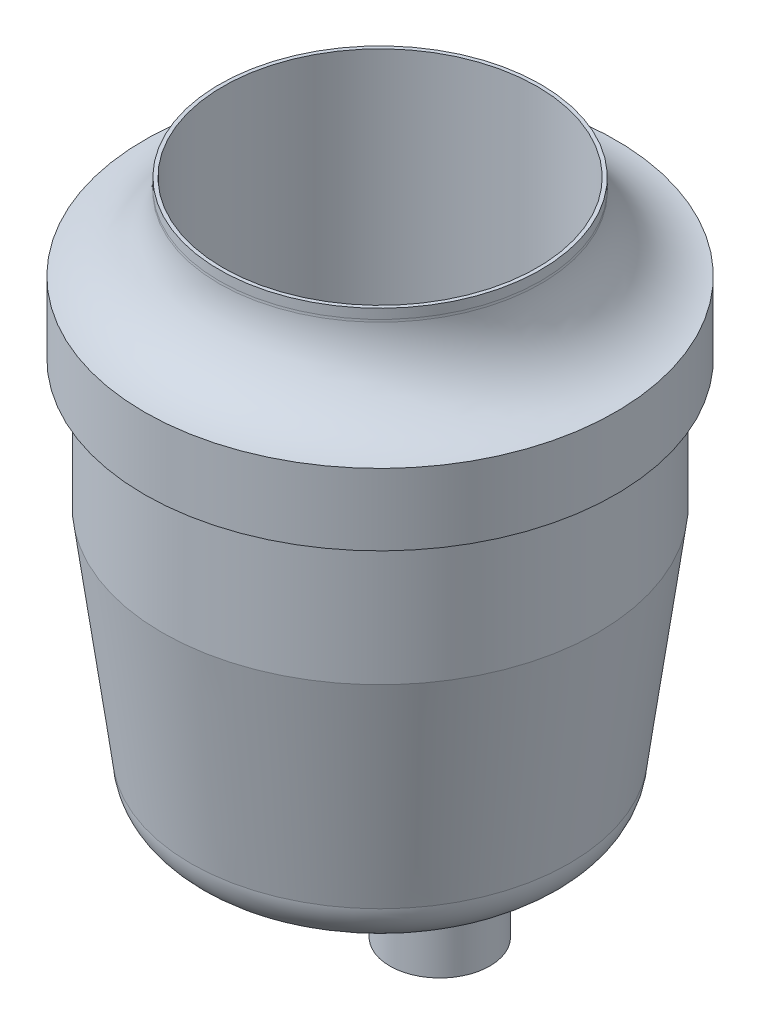
ISO-10303-21;
HEADER;
FILE_DESCRIPTION(('STEP AP214'),'2;1');
FILE_NAME('part.step','',(''),(''),'','','');
FILE_SCHEMA(('AUTOMOTIVE_DESIGN { 1 0 10303 214 1 1 1 1 }'));
ENDSEC;
DATA;
#1=APPLICATION_CONTEXT('core data for automotive mechanical design processes');
#2=APPLICATION_PROTOCOL_DEFINITION('international standard','automotive_design',2000,#1);
#3=PRODUCT_CONTEXT('',#1,'mechanical');
#4=PRODUCT('Part','Part','',(#3));
#5=PRODUCT_RELATED_PRODUCT_CATEGORY('part','',(#4));
#6=PRODUCT_DEFINITION_FORMATION('','',#4);
#7=PRODUCT_DEFINITION_CONTEXT('part definition',#1,'design');
#8=PRODUCT_DEFINITION('design','',#6,#7);
#9=PRODUCT_DEFINITION_SHAPE('','',#8);
#10=(LENGTH_UNIT() NAMED_UNIT(*) SI_UNIT(.MILLI.,.METRE.));
#11=(NAMED_UNIT(*) PLANE_ANGLE_UNIT() SI_UNIT($,.RADIAN.));
#12=(NAMED_UNIT(*) SI_UNIT($,.STERADIAN.) SOLID_ANGLE_UNIT());
#13=UNCERTAINTY_MEASURE_WITH_UNIT(LENGTH_MEASURE(1.E-05),#10,'distance_accuracy_value','');
#14=(GEOMETRIC_REPRESENTATION_CONTEXT(3) GLOBAL_UNCERTAINTY_ASSIGNED_CONTEXT((#13)) GLOBAL_UNIT_ASSIGNED_CONTEXT((#10,
#11,#12)) REPRESENTATION_CONTEXT('',''));
#15=CARTESIAN_POINT('',(0.,0.,0.));
#16=DIRECTION('',(0.,0.,1.));
#17=DIRECTION('',(1.,0.,0.));
#18=AXIS2_PLACEMENT_3D('',#15,#16,#17);
#19=CARTESIAN_POINT('',(0.,11.43,0.));
#20=DIRECTION('',(0.,-1.,0.));
#21=DIRECTION('',(0.,0.,-1.));
#22=AXIS2_PLACEMENT_3D('',#19,#20,#21);
#23=CYLINDRICAL_SURFACE('',#22,19.3675);
#24=CARTESIAN_POINT('',(0.,11.43,0.));
#25=DIRECTION('',(0.,1.,0.));
#26=DIRECTION('',(0.,0.,1.));
#27=AXIS2_PLACEMENT_3D('',#24,#25,#26);
#28=CIRCLE('',#27,19.3675);
#29=CARTESIAN_POINT('',(0.,11.43,19.3675));
#30=VERTEX_POINT('',#29);
#31=EDGE_CURVE('E210',#30,#30,#28,.T.);
#32=ORIENTED_EDGE('',*,*,#31,.F.);
#33=EDGE_LOOP('',(#32));
#34=FACE_BOUND('',#33,.T.);
#35=CARTESIAN_POINT('',(0.,0.,0.));
#36=DIRECTION('',(0.,1.,0.));
#37=DIRECTION('',(0.,0.,1.));
#38=AXIS2_PLACEMENT_3D('',#35,#36,#37);
#39=CIRCLE('',#38,19.3675);
#40=CARTESIAN_POINT('',(0.,0.,19.3675));
#41=VERTEX_POINT('',#40);
#42=EDGE_CURVE('E97',#41,#41,#39,.T.);
#43=ORIENTED_EDGE('',*,*,#42,.T.);
#44=EDGE_LOOP('',(#43));
#45=FACE_BOUND('',#44,.T.);
#46=ADVANCED_FACE('F39',(#34,#45),#23,.T.);
#47=CARTESIAN_POINT('',(0.,17.78,0.));
#48=DIRECTION('',(0.,-1.,0.));
#49=DIRECTION('',(0.,0.,-1.));
#50=AXIS2_PLACEMENT_3D('',#47,#48,#49);
#51=CYLINDRICAL_SURFACE('',#50,20.955);
#52=CARTESIAN_POINT('',(0.,17.78,0.));
#53=DIRECTION('',(0.,1.,0.));
#54=DIRECTION('',(0.,0.,1.));
#55=AXIS2_PLACEMENT_3D('',#52,#53,#54);
#56=CIRCLE('',#55,20.955);
#57=CARTESIAN_POINT('',(0.,17.78,20.955));
#58=VERTEX_POINT('',#57);
#59=EDGE_CURVE('E206',#58,#58,#56,.T.);
#60=ORIENTED_EDGE('',*,*,#59,.F.);
#61=EDGE_LOOP('',(#60));
#62=FACE_BOUND('',#61,.T.);
#63=CARTESIAN_POINT('',(0.,11.43,0.));
#64=DIRECTION('',(0.,1.,0.));
#65=DIRECTION('',(0.,0.,1.));
#66=AXIS2_PLACEMENT_3D('',#63,#64,#65);
#67=CIRCLE('',#66,20.955);
#68=CARTESIAN_POINT('',(0.,11.43,20.955));
#69=VERTEX_POINT('',#68);
#70=EDGE_CURVE('E205',#69,#69,#67,.T.);
#71=ORIENTED_EDGE('',*,*,#70,.T.);
#72=EDGE_LOOP('',(#71));
#73=FACE_BOUND('',#72,.T.);
#74=ADVANCED_FACE('F147',(#62,#73),#51,.T.);
#75=CARTESIAN_POINT('',(0.,11.43,0.));
#76=DIRECTION('',(0.,1.,0.));
#77=DIRECTION('',(0.,0.,1.));
#78=AXIS2_PLACEMENT_3D('',#75,#76,#77);
#79=PLANE('',#78);
#80=ORIENTED_EDGE('',*,*,#31,.T.);
#81=EDGE_LOOP('',(#80));
#82=FACE_BOUND('',#81,.T.);
#83=ORIENTED_EDGE('',*,*,#70,.F.);
#84=EDGE_LOOP('',(#83));
#85=FACE_BOUND('',#84,.T.);
#86=ADVANCED_FACE('F137',(#82,#85),#79,.F.);
#87=CARTESIAN_POINT('',(0.,24.92375,0.));
#88=DIRECTION('',(0.,-1.,0.));
#89=DIRECTION('',(0.,0.,-1.));
#90=AXIS2_PLACEMENT_3D('',#87,#88,#89);
#91=TOROIDAL_SURFACE('',#90,21.43125,7.15960740020008);
#92=CARTESIAN_POINT('',(0.,24.3310367279127,0.));
#93=DIRECTION('',(0.,1.,0.));
#94=DIRECTION('',(0.,0.,1.));
#95=AXIS2_PLACEMENT_3D('',#92,#93,#94);
#96=CIRCLE('',#95,14.2962188786879);
#97=CARTESIAN_POINT('',(0.,24.3310367279127,14.2962188786879));
#98=VERTEX_POINT('',#97);
#99=EDGE_CURVE('E221',#98,#98,#96,.F.);
#100=ORIENTED_EDGE('',*,*,#99,.T.);
#101=EDGE_LOOP('',(#100));
#102=FACE_BOUND('',#101,.T.);
#103=ORIENTED_EDGE('',*,*,#59,.T.);
#104=EDGE_LOOP('',(#103));
#105=FACE_BOUND('',#104,.T.);
#106=ADVANCED_FACE('F133',(#102,#105),#91,.F.);
#107=CARTESIAN_POINT('',(0.,25.4,0.));
#108=DIRECTION('',(0.,1.,0.));
#109=DIRECTION('',(0.,0.,1.));
#110=AXIS2_PLACEMENT_3D('',#107,#108,#109);
#111=PLANE('',#110);
#112=CARTESIAN_POINT('',(0.,25.4,0.));
#113=DIRECTION('',(0.,1.,0.));
#114=DIRECTION('',(0.,0.,1.));
#115=AXIS2_PLACEMENT_3D('',#112,#113,#114);
#116=CIRCLE('',#115,13.97);
#117=CARTESIAN_POINT('',(0.,25.4,13.97));
#118=VERTEX_POINT('',#117);
#119=EDGE_CURVE('E190',#118,#118,#116,.T.);
#120=ORIENTED_EDGE('',*,*,#119,.F.);
#121=EDGE_LOOP('',(#120));
#122=FACE_BOUND('',#121,.T.);
#123=CARTESIAN_POINT('',(0.,25.4,0.));
#124=DIRECTION('',(0.,1.,0.));
#125=DIRECTION('',(0.,0.,1.));
#126=AXIS2_PLACEMENT_3D('',#123,#124,#125);
#127=CIRCLE('',#126,14.2875);
#128=CARTESIAN_POINT('',(0.,25.4,-14.2875));
#129=VERTEX_POINT('',#128);
#130=EDGE_CURVE('E201',#129,#129,#127,.T.);
#131=ORIENTED_EDGE('',*,*,#130,.T.);
#132=EDGE_LOOP('',(#131));
#133=FACE_BOUND('',#132,.T.);
#134=ADVANCED_FACE('F136',(#122,#133),#111,.T.);
#135=CARTESIAN_POINT('',(0.,25.4,0.));
#136=DIRECTION('',(0.,-1.,0.));
#137=DIRECTION('',(0.,0.,-1.));
#138=AXIS2_PLACEMENT_3D('',#135,#136,#137);
#139=CYLINDRICAL_SURFACE('',#138,14.2875);
#140=CARTESIAN_POINT('',(0.,24.5413124632916,0.));
#141=DIRECTION('',(0.,1.,0.));
#142=DIRECTION('',(0.,0.,1.));
#143=AXIS2_PLACEMENT_3D('',#140,#141,#142);
#144=CIRCLE('',#143,14.2875);
#145=CARTESIAN_POINT('',(0.,24.5413124632916,-14.2875));
#146=VERTEX_POINT('',#145);
#147=EDGE_CURVE('E217',#146,#146,#144,.T.);
#148=CARTESIAN_POINT('',(0.,24.5413124632916,-14.2875));
#149=CARTESIAN_POINT('',(0.,24.5502571251324,-14.2875));
#150=CARTESIAN_POINT('',(0.,24.5592017869731,-14.2875));
#151=CARTESIAN_POINT('',(0.,24.5770911106545,-14.2875));
#152=CARTESIAN_POINT('',(0.,24.5860357724952,-14.2875));
#153=CARTESIAN_POINT('',(0.,24.6039250961766,-14.2875));
#154=CARTESIAN_POINT('',(0.,24.6128697580173,-14.2875));
#155=CARTESIAN_POINT('',(0.,24.6307590816988,-14.2875));
#156=CARTESIAN_POINT('',(0.,24.6397037435395,-14.2875));
#157=CARTESIAN_POINT('',(0.,24.6575930672209,-14.2875));
#158=CARTESIAN_POINT('',(0.,24.6665377290616,-14.2875));
#159=CARTESIAN_POINT('',(0.,24.684427052743,-14.2875));
#160=CARTESIAN_POINT('',(0.,24.6933717145837,-14.2875));
#161=CARTESIAN_POINT('',(0.,24.7112610382652,-14.2875));
#162=CARTESIAN_POINT('',(0.,24.7202057001059,-14.2875));
#163=CARTESIAN_POINT('',(0.,24.7380950237873,-14.2875));
#164=CARTESIAN_POINT('',(0.,24.747039685628,-14.2875));
#165=CARTESIAN_POINT('',(0.,24.7649290093094,-14.2875));
#166=CARTESIAN_POINT('',(0.,24.7738736711502,-14.2875));
#167=CARTESIAN_POINT('',(0.,24.7917629948316,-14.2875));
#168=CARTESIAN_POINT('',(0.,24.8007076566723,-14.2875));
#169=CARTESIAN_POINT('',(0.,24.8185969803537,-14.2875));
#170=CARTESIAN_POINT('',(0.,24.8275416421944,-14.2875));
#171=CARTESIAN_POINT('',(0.,24.8454309658758,-14.2875));
#172=CARTESIAN_POINT('',(0.,24.8543756277166,-14.2875));
#173=CARTESIAN_POINT('',(0.,24.872264951398,-14.2875));
#174=CARTESIAN_POINT('',(0.,24.8812096132387,-14.2875));
#175=CARTESIAN_POINT('',(0.,24.8990989369201,-14.2875));
#176=CARTESIAN_POINT('',(0.,24.9080435987608,-14.2875));
#177=CARTESIAN_POINT('',(0.,24.9259329224423,-14.2875));
#178=CARTESIAN_POINT('',(0.,24.934877584283,-14.2875));
#179=CARTESIAN_POINT('',(0.,24.9527669079644,-14.2875));
#180=CARTESIAN_POINT('',(0.,24.9617115698051,-14.2875));
#181=CARTESIAN_POINT('',(0.,24.9796008934865,-14.2875));
#182=CARTESIAN_POINT('',(0.,24.9885455553272,-14.2875));
#183=CARTESIAN_POINT('',(0.,25.0064348790087,-14.2875));
#184=CARTESIAN_POINT('',(0.,25.0153795408494,-14.2875));
#185=CARTESIAN_POINT('',(0.,25.0332688645308,-14.2875));
#186=CARTESIAN_POINT('',(0.,25.0422135263715,-14.2875));
#187=CARTESIAN_POINT('',(0.,25.0601028500529,-14.2875));
#188=CARTESIAN_POINT('',(0.,25.0690475118937,-14.2875));
#189=CARTESIAN_POINT('',(0.,25.0869368355751,-14.2875));
#190=CARTESIAN_POINT('',(0.,25.0958814974158,-14.2875));
#191=CARTESIAN_POINT('',(0.,25.1137708210972,-14.2875));
#192=CARTESIAN_POINT('',(0.,25.1227154829379,-14.2875));
#193=CARTESIAN_POINT('',(0.,25.1406048066193,-14.2875));
#194=CARTESIAN_POINT('',(0.,25.1495494684601,-14.2875));
#195=CARTESIAN_POINT('',(0.,25.1674387921415,-14.2875));
#196=CARTESIAN_POINT('',(0.,25.1763834539822,-14.2875));
#197=CARTESIAN_POINT('',(0.,25.1942727776636,-14.2875));
#198=CARTESIAN_POINT('',(0.,25.2032174395043,-14.2875));
#199=CARTESIAN_POINT('',(0.,25.2211067631858,-14.2875));
#200=CARTESIAN_POINT('',(0.,25.2300514250265,-14.2875));
#201=CARTESIAN_POINT('',(0.,25.2479407487079,-14.2875));
#202=CARTESIAN_POINT('',(0.,25.2568854105486,-14.2875));
#203=CARTESIAN_POINT('',(0.,25.27477473423,-14.2875));
#204=CARTESIAN_POINT('',(0.,25.2837193960707,-14.2875));
#205=CARTESIAN_POINT('',(0.,25.3016087197522,-14.2875));
#206=CARTESIAN_POINT('',(0.,25.3105533815929,-14.2875));
#207=CARTESIAN_POINT('',(0.,25.3284427052743,-14.2875));
#208=CARTESIAN_POINT('',(0.,25.337387367115,-14.2875));
#209=CARTESIAN_POINT('',(0.,25.3552766907964,-14.2875));
#210=CARTESIAN_POINT('',(0.,25.3642213526371,-14.2875));
#211=CARTESIAN_POINT('',(0.,25.3821106763186,-14.2875));
#212=CARTESIAN_POINT('',(0.,25.3910553381593,-14.2875));
#213=CARTESIAN_POINT('',(0.,25.4,-14.2875));
#214=B_SPLINE_CURVE_WITH_KNOTS('',3,(#148,#149,#150,#151,#152,#153,#154,#155,#156,#157,#158,
#159,#160,#161,#162,#163,#164,#165,#166,#167,#168,#169,#170,#171,#172,#173,#174,#175,#176,#177,
#178,#179,#180,#181,#182,#183,#184,#185,#186,#187,#188,#189,#190,#191,#192,#193,#194,#195,#196,
#197,#198,#199,#200,#201,#202,#203,#204,#205,#206,#207,#208,#209,#210,#211,#212,#213),
.UNSPECIFIED.,.F.,.F.,(4,2,2,2,2,2,2,2,2,2,2,2,2,2,2,2,2,2,2,2,2,2,2,2,2,2,2,2,2,2,2,2,4),(0.,
0.0268339855221331,0.0536679710442696,0.0805019565664061,0.107335942088543,0.134169927610679,
0.161003913132812,0.187837898654949,0.214671884177085,0.241505869699222,0.268339855221358,
0.295173840743491,0.322007826265628,0.348841811787765,0.375675797309901,0.402509782832038,
0.429343768354174,0.456177753876307,0.483011739398444,0.50984572492058,0.536679710442717,
0.563513695964853,0.590347681486986,0.617181667009123,0.644015652531259,0.670849638053396,
0.697683623575532,0.724517609097666,0.751351594619802,0.778185580141939,0.805019565664075,
0.831853551186212,0.858687536708348),.UNSPECIFIED.);
#215=EDGE_CURVE('BSEAM131',#146,#129,#214,.T.);
#216=ORIENTED_EDGE('',*,*,#147,.T.);
#217=ORIENTED_EDGE('',*,*,#130,.F.);
#218=ORIENTED_EDGE('',*,*,#215,.T.);
#219=ORIENTED_EDGE('',*,*,#215,.F.);
#220=EDGE_LOOP('',(#216,#218,#217,#219));
#221=FACE_BOUND('',#220,.T.);
#222=ADVANCED_FACE('F131',(#221),#139,.T.);
#223=CARTESIAN_POINT('',(0.,0.,0.));
#224=DIRECTION('',(0.,1.,0.));
#225=DIRECTION('',(0.,0.,1.));
#226=AXIS2_PLACEMENT_3D('',#223,#224,#225);
#227=CONICAL_SURFACE('',#226,19.3675,0.132551532296674);
#228=CARTESIAN_POINT('',(0.,-19.05,0.));
#229=DIRECTION('',(0.,1.,0.));
#230=DIRECTION('',(0.,0.,1.));
#231=AXIS2_PLACEMENT_3D('',#228,#229,#230);
#232=CIRCLE('',#231,16.8275);
#233=CARTESIAN_POINT('',(0.,-19.05,16.8275));
#234=VERTEX_POINT('',#233);
#235=EDGE_CURVE('E91',#234,#234,#232,.T.);
#236=ORIENTED_EDGE('',*,*,#235,.T.);
#237=EDGE_LOOP('',(#236));
#238=FACE_BOUND('',#237,.T.);
#239=ORIENTED_EDGE('',*,*,#42,.F.);
#240=EDGE_LOOP('',(#239));
#241=FACE_BOUND('',#240,.T.);
#242=ADVANCED_FACE('F127',(#238,#241),#227,.T.);
#243=CARTESIAN_POINT('',(0.,-18.89125,0.));
#244=DIRECTION('',(0.,1.,0.));
#245=DIRECTION('',(0.,0.,1.));
#246=AXIS2_PLACEMENT_3D('',#243,#244,#245);
#247=TOROIDAL_SURFACE('',#246,12.85875,3.97192373101499);
#248=CARTESIAN_POINT('',(0.,-22.86,0.));
#249=DIRECTION('',(0.,1.,0.));
#250=DIRECTION('',(0.,0.,1.));
#251=AXIS2_PLACEMENT_3D('',#248,#249,#250);
#252=CIRCLE('',#251,12.7);
#253=CARTESIAN_POINT('',(-12.2629171870465,-22.86,3.30315940633214));
#254=VERTEX_POINT('',#253);
#255=CARTESIAN_POINT('',(-12.2629171870465,-22.86,-3.30315940633214));
#256=VERTEX_POINT('',#255);
#257=EDGE_CURVE('E85',#254,#256,#252,.T.);
#258=ORIENTED_EDGE('',*,*,#257,.T.);
#259=CARTESIAN_POINT('',(-12.2629171870465,-22.86,-3.30315940633214));
#260=CARTESIAN_POINT('',(-12.2969321285737,-22.8606534997931,-3.23972804058578));
#261=CARTESIAN_POINT('',(-12.3299761871402,-22.8611868304515,-3.17577471182122));
#262=CARTESIAN_POINT('',(-12.3939987767139,-22.8620459721288,-3.04705920568285));
#263=CARTESIAN_POINT('',(-12.4249827100745,-22.8623723467584,-2.98229971908729));
#264=CARTESIAN_POINT('',(-12.4848639361844,-22.8628529245898,-2.85204163051852));
#265=CARTESIAN_POINT('',(-12.5137668192055,-22.8630076064753,-2.78654560036674));
#266=CARTESIAN_POINT('',(-12.5694681657041,-22.8631772187446,-2.65488487951941));
#267=CARTESIAN_POINT('',(-12.5962724001948,-22.8631925467496,-2.58872263089431));
#268=CARTESIAN_POINT('',(-12.6479837016203,-22.8631132458554,-2.45522684690976));
#269=CARTESIAN_POINT('',(-12.6728790819353,-22.863017989609,-2.38788878446865));
#270=CARTESIAN_POINT('',(-12.720555998402,-22.8627439024129,-2.25254005286079));
#271=CARTESIAN_POINT('',(-12.7433395062542,-22.8625651503783,-2.18453007802963));
#272=CARTESIAN_POINT('',(-12.7867758565728,-22.8621492402122,-2.04790647211982));
#273=CARTESIAN_POINT('',(-12.8074307600292,-22.8619121393445,-1.97929349611126));
#274=CARTESIAN_POINT('',(-12.8465954983539,-22.8614022929882,-1.84153322526428));
#275=CARTESIAN_POINT('',(-12.8651074827204,-22.8611295838121,-1.77238654137568));
#276=CARTESIAN_POINT('',(-12.9000221209891,-22.8605681080055,-1.63343750909297));
#277=CARTESIAN_POINT('',(-12.9164211286384,-22.8602793148174,-1.56363424456961));
#278=CARTESIAN_POINT('',(-12.9470570857566,-22.8597040503047,-1.42356512821328));
#279=CARTESIAN_POINT('',(-12.9612943376772,-22.8594175786605,-1.35329934252964));
#280=CARTESIAN_POINT('',(-12.9875955773393,-22.8588624839841,-1.21237443814992));
#281=CARTESIAN_POINT('',(-12.9996599319731,-22.8585938579434,-1.14171538793732));
#282=CARTESIAN_POINT('',(-13.0216062425673,-22.8580875855297,-1.00007343338865));
#283=CARTESIAN_POINT('',(-13.0314886310494,-22.8578499330209,-0.929090596087958));
#284=CARTESIAN_POINT('',(-13.0490670642554,-22.8574162768725,-0.786841950942941));
#285=CARTESIAN_POINT('',(-13.056762724961,-22.85722028055,-0.715576095622327));
#286=CARTESIAN_POINT('',(-13.0699600514815,-22.8568783192323,-0.572835822408896));
#287=CARTESIAN_POINT('',(-13.075461546369,-22.8567323581352,-0.50136138870435));
#288=CARTESIAN_POINT('',(-13.0842659385559,-22.8564964282531,-0.358273669321165));
#289=CARTESIAN_POINT('',(-13.0875687290914,-22.856406462187,-0.286660377069188));
#290=CARTESIAN_POINT('',(-13.091973032776,-22.8562860943811,-0.143364725115262));
#291=CARTESIAN_POINT('',(-13.0930745041504,-22.8562556937716,-0.071682364128414));
#292=CARTESIAN_POINT('',(-13.0930747722082,-22.8562556779585,0.0716698663083181));
#293=CARTESIAN_POINT('',(-13.0919739528945,-22.8562860521578,0.143339735757107));
#294=CARTESIAN_POINT('',(-13.087570928752,-22.8564063854949,0.286618759455369));
#295=CARTESIAN_POINT('',(-13.0842685096125,-22.8564963504333,0.358227907114455));
#296=CARTESIAN_POINT('',(-13.0754646043177,-22.8567322851068,0.501315668209939));
#297=CARTESIAN_POINT('',(-13.0699629693353,-22.8568782586321,0.572794272483179));
#298=CARTESIAN_POINT('',(-13.0567648739866,-22.8572202417225,0.715551205404006));
#299=CARTESIAN_POINT('',(-13.0490683299715,-22.8574162531946,0.786829526314154));
#300=CARTESIAN_POINT('',(-13.0314904301043,-22.8578498810955,0.929078218755488));
#301=CARTESIAN_POINT('',(-13.0216102213487,-22.8580874756668,1.00004873209592));
#302=CARTESIAN_POINT('',(-12.9996672214038,-22.8585936795727,1.14167434780541));
#303=CARTESIAN_POINT('',(-12.9876037433902,-22.8588622986574,1.21232934372981));
#304=CARTESIAN_POINT('',(-12.9613029818973,-22.8594174091613,1.35325437303793));
#305=CARTESIAN_POINT('',(-12.9470650793183,-22.8597039056567,1.42352429086142));
#306=CARTESIAN_POINT('',(-12.9164263154096,-22.8602792348582,1.56360984010467));
#307=CARTESIAN_POINT('',(-12.9000249020353,-22.860568068143,1.63342535079013));
#308=CARTESIAN_POINT('',(-12.865110787801,-22.8611295258113,1.77237447661747));
#309=CARTESIAN_POINT('',(-12.8466024802669,-22.8614021821834,1.84150919556602));
#310=CARTESIAN_POINT('',(-12.8074430334915,-22.8619119837142,1.97925367079761));
#311=CARTESIAN_POINT('',(-12.7867894961564,-22.8621490883913,2.0478627454887));
#312=CARTESIAN_POINT('',(-12.7433536104071,-22.8625650364904,2.18448656042836));
#313=CARTESIAN_POINT('',(-12.720568956356,-22.8627438158503,2.25250056784801));
#314=CARTESIAN_POINT('',(-12.6728872190997,-22.8630179617644,2.38786524323581));
#315=CARTESIAN_POINT('',(-12.6479879239367,-22.8631132397656,2.45521513227582));
#316=CARTESIAN_POINT('',(-12.5962749695318,-22.8631925424264,2.58871680764368));
#317=CARTESIAN_POINT('',(-12.5694735369686,-22.8631772234138,2.65487333017299));
#318=CARTESIAN_POINT('',(-12.513776081095,-22.8630076517615,2.78652652027615));
#319=CARTESIAN_POINT('',(-12.4848741653859,-22.8628529932284,2.85202069445163));
#320=CARTESIAN_POINT('',(-12.4249931577576,-22.8623724566236,2.98227893837312));
#321=CARTESIAN_POINT('',(-12.3940083575011,-22.8620460897709,3.04704038198148));
#322=CARTESIAN_POINT('',(-12.3299821017651,-22.8611869285228,3.17576352220193));
#323=CARTESIAN_POINT('',(-12.296935128809,-22.8606535584974,3.23972247070448));
#324=CARTESIAN_POINT('',(-12.2629171870465,-22.86,3.30315940633214));
#325=B_SPLINE_CURVE_WITH_KNOTS('',3,(#259,#260,#261,#262,#263,#264,#265,#266,#267,#268,#269,
#270,#271,#272,#273,#274,#275,#276,#277,#278,#279,#280,#281,#282,#283,#284,#285,#286,#287,#288,
#289,#290,#291,#292,#293,#294,#295,#296,#297,#298,#299,#300,#301,#302,#303,#304,#305,#306,#307,
#308,#309,#310,#311,#312,#313,#314,#315,#316,#317,#318,#319,#320,#321,#322,#323,#324),
.UNSPECIFIED.,.F.,.F.,(4,2,2,2,2,2,2,2,2,2,2,2,2,2,2,2,2,2,2,2,2,2,2,2,2,2,2,2,2,2,2,2,4),(0.,
0.21592868834474,0.431266775942457,0.646002975744998,0.860126271591182,1.07547025443394,
1.29061111750179,1.50554167682355,1.7202547425151,1.93533350157918,2.15038214115176,
2.36539443577867,2.580364071106,2.79537143464111,3.01039554417255,3.22543009401558,
3.44046872455747,3.65546986311444,3.87049193360911,4.08552855770243,4.30057337801277,
4.51550550092704,4.73050535620058,4.94556654050526,5.16068270666981,5.3753582540279,
5.59027641816278,5.80542985092698,6.02081117787466,6.23491539899424,6.44964532517265,
6.66498983038074,6.88093750179466),.UNSPECIFIED.);
#326=EDGE_CURVE('E54',#256,#254,#325,.T.);
#327=ORIENTED_EDGE('',*,*,#326,.T.);
#328=EDGE_LOOP('',(#258,#327));
#329=FACE_BOUND('',#328,.T.);
#330=ORIENTED_EDGE('',*,*,#235,.F.);
#331=EDGE_LOOP('',(#330));
#332=FACE_BOUND('',#331,.T.);
#333=ADVANCED_FACE('F88',(#329,#332),#247,.T.);
#334=CARTESIAN_POINT('',(0.,-22.86,12.7));
#335=DIRECTION('',(0.,-1.,0.));
#336=DIRECTION('',(0.,0.,-1.));
#337=AXIS2_PLACEMENT_3D('',#334,#335,#336);
#338=PLANE('',#337);
#339=CARTESIAN_POINT('',(5.31267754417793,-22.86,0.));
#340=DIRECTION('',(0.,-1.,0.));
#341=DIRECTION('',(0.,0.,-1.));
#342=AXIS2_PLACEMENT_3D('',#339,#340,#341);
#343=CIRCLE('',#342,6.985);
#344=CARTESIAN_POINT('',(-0.397809188090623,-22.86,4.02250746184328));
#345=VERTEX_POINT('',#344);
#346=CARTESIAN_POINT('',(-0.397809188090623,-22.86,-4.02250746184328));
#347=VERTEX_POINT('',#346);
#348=EDGE_CURVE('E62',#345,#347,#343,.F.);
#349=ORIENTED_EDGE('',*,*,#348,.T.);
#350=CARTESIAN_POINT('',(-6.10829592035917,-22.86,0.));
#351=DIRECTION('',(0.,-1.,0.));
#352=DIRECTION('',(0.,0.,-1.));
#353=AXIS2_PLACEMENT_3D('',#350,#351,#352);
#354=CIRCLE('',#353,6.985);
#355=EDGE_CURVE('E79',#347,#256,#354,.F.);
#356=ORIENTED_EDGE('',*,*,#355,.T.);
#357=ORIENTED_EDGE('',*,*,#257,.F.);
#358=CARTESIAN_POINT('',(-6.10829592035917,-22.86,0.));
#359=DIRECTION('',(0.,-1.,0.));
#360=DIRECTION('',(0.,0.,-1.));
#361=AXIS2_PLACEMENT_3D('',#358,#359,#360);
#362=CIRCLE('',#361,6.985);
#363=EDGE_CURVE('E67',#254,#345,#362,.F.);
#364=ORIENTED_EDGE('',*,*,#363,.T.);
#365=EDGE_LOOP('',(#349,#356,#357,#364));
#366=FACE_BOUND('',#365,.T.);
#367=ADVANCED_FACE('F84',(#366),#338,.T.);
#368=CARTESIAN_POINT('',(-6.10829592035917,-30.48,0.));
#369=DIRECTION('',(0.,1.,0.));
#370=DIRECTION('',(0.,0.,1.));
#371=AXIS2_PLACEMENT_3D('',#368,#369,#370);
#372=CYLINDRICAL_SURFACE('',#371,4.445);
#373=CARTESIAN_POINT('',(-6.10829592035917,-25.4,0.));
#374=DIRECTION('',(0.,-1.,0.));
#375=DIRECTION('',(0.,0.,-1.));
#376=AXIS2_PLACEMENT_3D('',#373,#374,#375);
#377=CIRCLE('',#376,4.445);
#378=CARTESIAN_POINT('',(-6.10829592035917,-25.4,4.445));
#379=VERTEX_POINT('',#378);
#380=EDGE_CURVE('E108',#379,#379,#377,.T.);
#381=CARTESIAN_POINT('',(-6.10829592035917,-30.48,0.));
#382=DIRECTION('',(0.,-1.,0.));
#383=DIRECTION('',(0.,0.,-1.));
#384=AXIS2_PLACEMENT_3D('',#381,#382,#383);
#385=CIRCLE('',#384,4.445);
#386=CARTESIAN_POINT('',(-6.10829592035917,-30.48,4.44499999999999));
#387=VERTEX_POINT('',#386);
#388=EDGE_CURVE('E92',#387,#387,#385,.T.);
#389=CARTESIAN_POINT('',(-6.10829592035917,-25.4,4.445));
#390=CARTESIAN_POINT('',(-6.10829592035917,-25.4529166666667,4.445));
#391=CARTESIAN_POINT('',(-6.10829592035917,-25.5058333333333,4.445));
#392=CARTESIAN_POINT('',(-6.10829592035917,-25.6116666666667,4.445));
#393=CARTESIAN_POINT('',(-6.10829592035917,-25.6645833333333,4.445));
#394=CARTESIAN_POINT('',(-6.10829592035917,-25.7704166666667,4.445));
#395=CARTESIAN_POINT('',(-6.10829592035917,-25.8233333333333,4.445));
#396=CARTESIAN_POINT('',(-6.10829592035917,-25.9291666666667,4.445));
#397=CARTESIAN_POINT('',(-6.10829592035917,-25.9820833333333,4.445));
#398=CARTESIAN_POINT('',(-6.10829592035917,-26.0879166666667,4.445));
#399=CARTESIAN_POINT('',(-6.10829592035917,-26.1408333333333,4.445));
#400=CARTESIAN_POINT('',(-6.10829592035917,-26.2466666666667,4.445));
#401=CARTESIAN_POINT('',(-6.10829592035917,-26.2995833333333,4.445));
#402=CARTESIAN_POINT('',(-6.10829592035917,-26.4054166666667,4.445));
#403=CARTESIAN_POINT('',(-6.10829592035917,-26.4583333333333,4.445));
#404=CARTESIAN_POINT('',(-6.10829592035917,-26.5641666666667,4.445));
#405=CARTESIAN_POINT('',(-6.10829592035917,-26.6170833333333,4.445));
#406=CARTESIAN_POINT('',(-6.10829592035917,-26.7229166666667,4.445));
#407=CARTESIAN_POINT('',(-6.10829592035917,-26.7758333333333,4.445));
#408=CARTESIAN_POINT('',(-6.10829592035917,-26.8816666666667,4.445));
#409=CARTESIAN_POINT('',(-6.10829592035917,-26.9345833333333,4.445));
#410=CARTESIAN_POINT('',(-6.10829592035917,-27.0404166666667,4.445));
#411=CARTESIAN_POINT('',(-6.10829592035917,-27.0933333333333,4.445));
#412=CARTESIAN_POINT('',(-6.10829592035917,-27.1991666666667,4.445));
#413=CARTESIAN_POINT('',(-6.10829592035917,-27.2520833333333,4.445));
#414=CARTESIAN_POINT('',(-6.10829592035917,-27.3579166666667,4.445));
#415=CARTESIAN_POINT('',(-6.10829592035917,-27.4108333333333,4.445));
#416=CARTESIAN_POINT('',(-6.10829592035917,-27.5166666666667,4.445));
#417=CARTESIAN_POINT('',(-6.10829592035917,-27.5695833333333,4.44499999999999));
#418=CARTESIAN_POINT('',(-6.10829592035917,-27.6754166666667,4.44499999999999));
#419=CARTESIAN_POINT('',(-6.10829592035917,-27.7283333333333,4.44499999999999));
#420=CARTESIAN_POINT('',(-6.10829592035917,-27.8341666666667,4.44499999999999));
#421=CARTESIAN_POINT('',(-6.10829592035917,-27.8870833333333,4.44499999999999));
#422=CARTESIAN_POINT('',(-6.10829592035917,-27.9929166666667,4.44499999999999));
#423=CARTESIAN_POINT('',(-6.10829592035917,-28.0458333333333,4.44499999999999));
#424=CARTESIAN_POINT('',(-6.10829592035917,-28.1516666666667,4.44499999999999));
#425=CARTESIAN_POINT('',(-6.10829592035917,-28.2045833333333,4.44499999999999));
#426=CARTESIAN_POINT('',(-6.10829592035917,-28.3104166666667,4.44499999999999));
#427=CARTESIAN_POINT('',(-6.10829592035917,-28.3633333333333,4.44499999999999));
#428=CARTESIAN_POINT('',(-6.10829592035917,-28.4691666666667,4.44499999999999));
#429=CARTESIAN_POINT('',(-6.10829592035917,-28.5220833333333,4.44499999999999));
#430=CARTESIAN_POINT('',(-6.10829592035917,-28.6279166666667,4.44499999999999));
#431=CARTESIAN_POINT('',(-6.10829592035917,-28.6808333333333,4.44499999999999));
#432=CARTESIAN_POINT('',(-6.10829592035917,-28.7866666666667,4.44499999999999));
#433=CARTESIAN_POINT('',(-6.10829592035917,-28.8395833333333,4.44499999999999));
#434=CARTESIAN_POINT('',(-6.10829592035917,-28.9454166666667,4.44499999999999));
#435=CARTESIAN_POINT('',(-6.10829592035917,-28.9983333333333,4.44499999999999));
#436=CARTESIAN_POINT('',(-6.10829592035917,-29.1041666666667,4.44499999999999));
#437=CARTESIAN_POINT('',(-6.10829592035917,-29.1570833333333,4.44499999999999));
#438=CARTESIAN_POINT('',(-6.10829592035917,-29.2629166666667,4.44499999999999));
#439=CARTESIAN_POINT('',(-6.10829592035917,-29.3158333333333,4.44499999999999));
#440=CARTESIAN_POINT('',(-6.10829592035917,-29.4216666666667,4.44499999999999));
#441=CARTESIAN_POINT('',(-6.10829592035917,-29.4745833333333,4.44499999999999));
#442=CARTESIAN_POINT('',(-6.10829592035917,-29.5804166666667,4.44499999999999));
#443=CARTESIAN_POINT('',(-6.10829592035917,-29.6333333333333,4.44499999999999));
#444=CARTESIAN_POINT('',(-6.10829592035917,-29.7391666666667,4.44499999999999));
#445=CARTESIAN_POINT('',(-6.10829592035917,-29.7920833333333,4.44499999999999));
#446=CARTESIAN_POINT('',(-6.10829592035917,-29.8979166666667,4.44499999999999));
#447=CARTESIAN_POINT('',(-6.10829592035917,-29.9508333333333,4.44499999999999));
#448=CARTESIAN_POINT('',(-6.10829592035917,-30.0566666666667,4.44499999999999));
#449=CARTESIAN_POINT('',(-6.10829592035917,-30.1095833333333,4.44499999999999));
#450=CARTESIAN_POINT('',(-6.10829592035917,-30.2154166666667,4.44499999999999));
#451=CARTESIAN_POINT('',(-6.10829592035917,-30.2683333333333,4.44499999999999));
#452=CARTESIAN_POINT('',(-6.10829592035917,-30.3741666666667,4.44499999999999));
#453=CARTESIAN_POINT('',(-6.10829592035917,-30.4270833333333,4.44499999999999));
#454=CARTESIAN_POINT('',(-6.10829592035917,-30.48,4.44499999999999));
#455=B_SPLINE_CURVE_WITH_KNOTS('',3,(#389,#390,#391,#392,#393,#394,#395,#396,#397,#398,#399,
#400,#401,#402,#403,#404,#405,#406,#407,#408,#409,#410,#411,#412,#413,#414,#415,#416,#417,#418,
#419,#420,#421,#422,#423,#424,#425,#426,#427,#428,#429,#430,#431,#432,#433,#434,#435,#436,#437,
#438,#439,#440,#441,#442,#443,#444,#445,#446,#447,#448,#449,#450,#451,#452,#453,#454),
.UNSPECIFIED.,.F.,.F.,(4,2,2,2,2,2,2,2,2,2,2,2,2,2,2,2,2,2,2,2,2,2,2,2,2,2,2,2,2,2,2,2,4),(0.,
0.158749999999999,0.317499999999998,0.476249999999998,0.635,0.793749999999999,0.952499999999998,
1.11125,1.27,1.42875,1.5875,1.74625,1.905,2.06375,2.2225,2.38124999999999,2.54,2.69875,2.8575,
3.01624999999999,3.17499999999999,3.33375,3.4925,3.65124999999999,3.80999999999999,
3.96874999999999,4.1275,4.28624999999999,4.44499999999999,4.60374999999999,4.76249999999999,
4.92124999999999,5.07999999999999),.UNSPECIFIED.);
#456=EDGE_CURVE('BSEAM228',#379,#387,#455,.T.);
#457=ORIENTED_EDGE('',*,*,#380,.T.);
#458=ORIENTED_EDGE('',*,*,#388,.F.);
#459=ORIENTED_EDGE('',*,*,#456,.T.);
#460=ORIENTED_EDGE('',*,*,#456,.F.);
#461=EDGE_LOOP('',(#457,#459,#458,#460));
#462=FACE_BOUND('',#461,.T.);
#463=ADVANCED_FACE('F228',(#462),#372,.T.);
#464=CARTESIAN_POINT('',(-6.10829592035917,-30.48,0.));
#465=DIRECTION('',(0.,-1.,0.));
#466=DIRECTION('',(0.,0.,-1.));
#467=AXIS2_PLACEMENT_3D('',#464,#465,#466);
#468=PLANE('',#467);
#469=ORIENTED_EDGE('',*,*,#388,.T.);
#470=EDGE_LOOP('',(#469));
#471=FACE_BOUND('',#470,.T.);
#472=ADVANCED_FACE('F231',(#471),#468,.T.);
#473=CARTESIAN_POINT('',(5.31267754417793,-30.48,0.));
#474=DIRECTION('',(0.,1.,0.));
#475=DIRECTION('',(0.,0.,1.));
#476=AXIS2_PLACEMENT_3D('',#473,#474,#475);
#477=CYLINDRICAL_SURFACE('',#476,4.445);
#478=CARTESIAN_POINT('',(5.31267754417793,-25.4,0.));
#479=DIRECTION('',(0.,-1.,0.));
#480=DIRECTION('',(0.,0.,-1.));
#481=AXIS2_PLACEMENT_3D('',#478,#479,#480);
#482=CIRCLE('',#481,4.445);
#483=CARTESIAN_POINT('',(5.31267754417793,-25.4,4.445));
#484=VERTEX_POINT('',#483);
#485=EDGE_CURVE('E11',#484,#484,#482,.T.);
#486=CARTESIAN_POINT('',(5.31267754417793,-30.48,0.));
#487=DIRECTION('',(0.,-1.,0.));
#488=DIRECTION('',(0.,0.,-1.));
#489=AXIS2_PLACEMENT_3D('',#486,#487,#488);
#490=CIRCLE('',#489,4.445);
#491=CARTESIAN_POINT('',(5.31267754417793,-30.48,4.44499999999999));
#492=VERTEX_POINT('',#491);
#493=EDGE_CURVE('E100',#492,#492,#490,.T.);
#494=CARTESIAN_POINT('',(5.31267754417793,-25.4,4.445));
#495=CARTESIAN_POINT('',(5.31267754417793,-25.4529166666667,4.445));
#496=CARTESIAN_POINT('',(5.31267754417793,-25.5058333333333,4.445));
#497=CARTESIAN_POINT('',(5.31267754417793,-25.6116666666667,4.445));
#498=CARTESIAN_POINT('',(5.31267754417793,-25.6645833333333,4.445));
#499=CARTESIAN_POINT('',(5.31267754417793,-25.7704166666667,4.445));
#500=CARTESIAN_POINT('',(5.31267754417793,-25.8233333333333,4.445));
#501=CARTESIAN_POINT('',(5.31267754417793,-25.9291666666667,4.445));
#502=CARTESIAN_POINT('',(5.31267754417793,-25.9820833333333,4.445));
#503=CARTESIAN_POINT('',(5.31267754417793,-26.0879166666667,4.445));
#504=CARTESIAN_POINT('',(5.31267754417793,-26.1408333333333,4.445));
#505=CARTESIAN_POINT('',(5.31267754417793,-26.2466666666667,4.445));
#506=CARTESIAN_POINT('',(5.31267754417793,-26.2995833333333,4.445));
#507=CARTESIAN_POINT('',(5.31267754417793,-26.4054166666667,4.445));
#508=CARTESIAN_POINT('',(5.31267754417793,-26.4583333333333,4.445));
#509=CARTESIAN_POINT('',(5.31267754417793,-26.5641666666667,4.445));
#510=CARTESIAN_POINT('',(5.31267754417793,-26.6170833333333,4.445));
#511=CARTESIAN_POINT('',(5.31267754417793,-26.7229166666667,4.445));
#512=CARTESIAN_POINT('',(5.31267754417793,-26.7758333333333,4.445));
#513=CARTESIAN_POINT('',(5.31267754417793,-26.8816666666667,4.445));
#514=CARTESIAN_POINT('',(5.31267754417793,-26.9345833333333,4.445));
#515=CARTESIAN_POINT('',(5.31267754417793,-27.0404166666667,4.445));
#516=CARTESIAN_POINT('',(5.31267754417793,-27.0933333333333,4.445));
#517=CARTESIAN_POINT('',(5.31267754417793,-27.1991666666667,4.445));
#518=CARTESIAN_POINT('',(5.31267754417793,-27.2520833333333,4.445));
#519=CARTESIAN_POINT('',(5.31267754417793,-27.3579166666667,4.445));
#520=CARTESIAN_POINT('',(5.31267754417793,-27.4108333333333,4.445));
#521=CARTESIAN_POINT('',(5.31267754417793,-27.5166666666667,4.445));
#522=CARTESIAN_POINT('',(5.31267754417793,-27.5695833333333,4.44499999999999));
#523=CARTESIAN_POINT('',(5.31267754417793,-27.6754166666667,4.44499999999999));
#524=CARTESIAN_POINT('',(5.31267754417793,-27.7283333333333,4.44499999999999));
#525=CARTESIAN_POINT('',(5.31267754417793,-27.8341666666667,4.44499999999999));
#526=CARTESIAN_POINT('',(5.31267754417793,-27.8870833333333,4.44499999999999));
#527=CARTESIAN_POINT('',(5.31267754417793,-27.9929166666667,4.44499999999999));
#528=CARTESIAN_POINT('',(5.31267754417793,-28.0458333333333,4.44499999999999));
#529=CARTESIAN_POINT('',(5.31267754417793,-28.1516666666667,4.44499999999999));
#530=CARTESIAN_POINT('',(5.31267754417793,-28.2045833333333,4.44499999999999));
#531=CARTESIAN_POINT('',(5.31267754417793,-28.3104166666667,4.44499999999999));
#532=CARTESIAN_POINT('',(5.31267754417793,-28.3633333333333,4.44499999999999));
#533=CARTESIAN_POINT('',(5.31267754417793,-28.4691666666667,4.44499999999999));
#534=CARTESIAN_POINT('',(5.31267754417793,-28.5220833333333,4.44499999999999));
#535=CARTESIAN_POINT('',(5.31267754417793,-28.6279166666667,4.44499999999999));
#536=CARTESIAN_POINT('',(5.31267754417793,-28.6808333333333,4.44499999999999));
#537=CARTESIAN_POINT('',(5.31267754417793,-28.7866666666667,4.44499999999999));
#538=CARTESIAN_POINT('',(5.31267754417793,-28.8395833333333,4.44499999999999));
#539=CARTESIAN_POINT('',(5.31267754417793,-28.9454166666667,4.44499999999999));
#540=CARTESIAN_POINT('',(5.31267754417793,-28.9983333333333,4.44499999999999));
#541=CARTESIAN_POINT('',(5.31267754417793,-29.1041666666667,4.44499999999999));
#542=CARTESIAN_POINT('',(5.31267754417793,-29.1570833333333,4.44499999999999));
#543=CARTESIAN_POINT('',(5.31267754417793,-29.2629166666667,4.44499999999999));
#544=CARTESIAN_POINT('',(5.31267754417793,-29.3158333333333,4.44499999999999));
#545=CARTESIAN_POINT('',(5.31267754417793,-29.4216666666667,4.44499999999999));
#546=CARTESIAN_POINT('',(5.31267754417793,-29.4745833333333,4.44499999999999));
#547=CARTESIAN_POINT('',(5.31267754417793,-29.5804166666667,4.44499999999999));
#548=CARTESIAN_POINT('',(5.31267754417793,-29.6333333333333,4.44499999999999));
#549=CARTESIAN_POINT('',(5.31267754417793,-29.7391666666667,4.44499999999999));
#550=CARTESIAN_POINT('',(5.31267754417793,-29.7920833333333,4.44499999999999));
#551=CARTESIAN_POINT('',(5.31267754417793,-29.8979166666667,4.44499999999999));
#552=CARTESIAN_POINT('',(5.31267754417793,-29.9508333333333,4.44499999999999));
#553=CARTESIAN_POINT('',(5.31267754417793,-30.0566666666667,4.44499999999999));
#554=CARTESIAN_POINT('',(5.31267754417793,-30.1095833333333,4.44499999999999));
#555=CARTESIAN_POINT('',(5.31267754417793,-30.2154166666667,4.44499999999999));
#556=CARTESIAN_POINT('',(5.31267754417793,-30.2683333333333,4.44499999999999));
#557=CARTESIAN_POINT('',(5.31267754417793,-30.3741666666667,4.44499999999999));
#558=CARTESIAN_POINT('',(5.31267754417793,-30.4270833333333,4.44499999999999));
#559=CARTESIAN_POINT('',(5.31267754417793,-30.48,4.44499999999999));
#560=B_SPLINE_CURVE_WITH_KNOTS('',3,(#494,#495,#496,#497,#498,#499,#500,#501,#502,#503,#504,
#505,#506,#507,#508,#509,#510,#511,#512,#513,#514,#515,#516,#517,#518,#519,#520,#521,#522,#523,
#524,#525,#526,#527,#528,#529,#530,#531,#532,#533,#534,#535,#536,#537,#538,#539,#540,#541,#542,
#543,#544,#545,#546,#547,#548,#549,#550,#551,#552,#553,#554,#555,#556,#557,#558,#559),
.UNSPECIFIED.,.F.,.F.,(4,2,2,2,2,2,2,2,2,2,2,2,2,2,2,2,2,2,2,2,2,2,2,2,2,2,2,2,2,2,2,2,4),(0.,
0.158749999999999,0.317499999999998,0.476249999999998,0.635,0.793749999999999,0.952499999999998,
1.11125,1.27,1.42875,1.5875,1.74625,1.905,2.06375,2.2225,2.38124999999999,2.54,2.69875,2.8575,
3.01624999999999,3.17499999999999,3.33375,3.4925,3.65124999999999,3.80999999999999,
3.96874999999999,4.1275,4.28624999999999,4.44499999999999,4.60374999999999,4.76249999999999,
4.92124999999999,5.07999999999999),.UNSPECIFIED.);
#561=EDGE_CURVE('BSEAM235',#484,#492,#560,.T.);
#562=ORIENTED_EDGE('',*,*,#485,.T.);
#563=ORIENTED_EDGE('',*,*,#493,.F.);
#564=ORIENTED_EDGE('',*,*,#561,.T.);
#565=ORIENTED_EDGE('',*,*,#561,.F.);
#566=EDGE_LOOP('',(#562,#564,#563,#565));
#567=FACE_BOUND('',#566,.T.);
#568=ADVANCED_FACE('F235',(#567),#477,.T.);
#569=CARTESIAN_POINT('',(5.31267754417793,-30.48,0.));
#570=DIRECTION('',(0.,-1.,0.));
#571=DIRECTION('',(0.,0.,-1.));
#572=AXIS2_PLACEMENT_3D('',#569,#570,#571);
#573=PLANE('',#572);
#574=ORIENTED_EDGE('',*,*,#493,.T.);
#575=EDGE_LOOP('',(#574));
#576=FACE_BOUND('',#575,.T.);
#577=ADVANCED_FACE('F158',(#576),#573,.T.);
#578=CARTESIAN_POINT('',(0.,24.5413124632916,0.));
#579=DIRECTION('',(0.,1.,0.));
#580=DIRECTION('',(0.,0.,1.));
#581=AXIS2_PLACEMENT_3D('',#578,#579,#580);
#582=TOROIDAL_SURFACE('',#581,16.8275,2.54);
#583=ORIENTED_EDGE('',*,*,#99,.F.);
#584=EDGE_LOOP('',(#583));
#585=FACE_BOUND('',#584,.T.);
#586=ORIENTED_EDGE('',*,*,#147,.F.);
#587=EDGE_LOOP('',(#586));
#588=FACE_BOUND('',#587,.T.);
#589=ADVANCED_FACE('F155',(#585,#588),#582,.F.);
#590=CARTESIAN_POINT('',(5.31267754417793,-25.4,0.));
#591=DIRECTION('',(0.,-1.,0.));
#592=DIRECTION('',(0.,0.,-1.));
#593=AXIS2_PLACEMENT_3D('',#590,#591,#592);
#594=TOROIDAL_SURFACE('',#593,6.985,2.54);
#595=ORIENTED_EDGE('',*,*,#485,.F.);
#596=EDGE_LOOP('',(#595));
#597=FACE_BOUND('',#596,.T.);
#598=CARTESIAN_POINT('',(-0.397809188090622,-22.86,4.02250746184328));
#599=CARTESIAN_POINT('',(-0.397809188090622,-22.8599999961659,4.01904494157324));
#600=CARTESIAN_POINT('',(-0.397809188090622,-22.860002344214,4.01558242319935));
#601=CARTESIAN_POINT('',(-0.397809188090622,-22.8604613685022,3.67652977968547));
#602=CARTESIAN_POINT('',(-0.397809188090622,-22.8828936481013,3.34097260839415));
#603=CARTESIAN_POINT('',(-0.397809188090622,-22.9328657226498,2.83934709515296));
#604=CARTESIAN_POINT('',(-0.397809188090622,-22.9522882376839,2.67215552895048));
#605=CARTESIAN_POINT('',(-0.397809188090622,-22.9937213265564,2.33807257630519));
#606=CARTESIAN_POINT('',(-0.397809188090622,-23.0157317128691,2.17118116900058));
#607=CARTESIAN_POINT('',(-0.397809188090622,-23.0593493028516,1.83766853617689));
#608=CARTESIAN_POINT('',(-0.397809188090622,-23.0809571734097,1.67104737807146));
#609=CARTESIAN_POINT('',(-0.397809188090622,-23.1208645895772,1.3374115403092));
#610=CARTESIAN_POINT('',(-0.397809188090622,-23.1391646263739,1.17039692281534));
#611=CARTESIAN_POINT('',(-0.397809188090622,-23.1697033771739,0.836422636201383));
#612=CARTESIAN_POINT('',(-0.397809188090622,-23.1819647331861,0.669465144053398));
#613=CARTESIAN_POINT('',(-0.397809188090622,-23.1985621889811,0.335159751158462));
#614=CARTESIAN_POINT('',(-0.397809188090622,-23.2028995065647,0.167811914360276));
#615=CARTESIAN_POINT('',(-0.397809188090622,-23.2029152563641,-0.166922654289554));
#616=CARTESIAN_POINT('',(-0.397809188090622,-23.1985916987856,-0.334309386243052));
#617=CARTESIAN_POINT('',(-0.397809188090622,-23.1820157501436,-0.668692875190482));
#618=CARTESIAN_POINT('',(-0.397809188090622,-23.1697621404752,-0.835689568288445));
#619=CARTESIAN_POINT('',(-0.397809188090621,-23.1392327838906,-1.16974223374011));
#620=CARTESIAN_POINT('',(-0.397809188090622,-23.1209343674364,-1.33679602759712));
#621=CARTESIAN_POINT('',(-0.397809188090622,-23.0810253322874,-1.67050971863492));
#622=CARTESIAN_POINT('',(-0.397809188090622,-23.0594142209373,-1.83716955347759));
#623=CARTESIAN_POINT('',(-0.397809188090622,-23.0157872402283,-2.17075924523426));
#624=CARTESIAN_POINT('',(-0.397809188090621,-22.9937706985891,-2.33768903401388));
#625=CARTESIAN_POINT('',(-0.397809188090622,-22.9523244893827,-2.67184865048928));
#626=CARTESIAN_POINT('',(-0.397809188090624,-22.9328950092827,-2.83907849903947));
#627=CARTESIAN_POINT('',(-0.397809188090617,-22.8829039639245,-3.34081868613658));
#628=CARTESIAN_POINT('',(-0.397809188090596,-22.860461472958,-3.67645276029773));
#629=CARTESIAN_POINT('',(-0.397809188090622,-22.8600023442121,-4.0155824231884));
#630=CARTESIAN_POINT('',(-0.397809188090623,-22.859999996164,-4.01904494156213));
#631=CARTESIAN_POINT('',(-0.397809188090623,-22.86,-4.02250746184329));
#632=B_SPLINE_CURVE_WITH_KNOTS('',3,(#598,#599,#600,#601,#602,#603,#604,#605,#606,#607,#608,
#609,#610,#611,#612,#613,#614,#615,#616,#617,#618,#619,#620,#621,#622,#623,#624,#625,#626,#627,
#628,#629,#630,#631),.UNSPECIFIED.,.F.,.F.,(4,2,2,2,2,2,2,2,2,2,2,2,2,2,2,2,4),(0.,
0.0103875558895032,1.01715903638535,1.52217545551481,2.02715530203961,2.53120668993367,
3.03518316858602,3.53725532349626,4.0392503112669,4.54136064318818,5.04354815233851,
5.54764078584335,6.0518084595483,6.55690487490671,7.06203787132973,8.0690404134247,
8.0794279693142),.UNSPECIFIED.);
#633=EDGE_CURVE('E44',#347,#345,#632,.F.);
#634=ORIENTED_EDGE('',*,*,#633,.F.);
#635=ORIENTED_EDGE('',*,*,#348,.F.);
#636=EDGE_LOOP('',(#634,#635));
#637=FACE_BOUND('',#636,.T.);
#638=ADVANCED_FACE('F41',(#597,#637),#594,.F.);
#639=CARTESIAN_POINT('',(-6.10829592035917,-25.4,0.));
#640=DIRECTION('',(0.,-1.,0.));
#641=DIRECTION('',(0.,0.,-1.));
#642=AXIS2_PLACEMENT_3D('',#639,#640,#641);
#643=TOROIDAL_SURFACE('',#642,6.985,2.54);
#644=ORIENTED_EDGE('',*,*,#355,.F.);
#645=ORIENTED_EDGE('',*,*,#633,.T.);
#646=ORIENTED_EDGE('',*,*,#363,.F.);
#647=ORIENTED_EDGE('',*,*,#326,.F.);
#648=EDGE_LOOP('',(#644,#645,#646,#647));
#649=FACE_BOUND('',#648,.T.);
#650=ORIENTED_EDGE('',*,*,#380,.F.);
#651=EDGE_LOOP('',(#650));
#652=FACE_BOUND('',#651,.T.);
#653=ADVANCED_FACE('F76',(#649,#652),#643,.F.);
#654=CARTESIAN_POINT('',(0.,0.,0.));
#655=DIRECTION('',(0.,1.,0.));
#656=DIRECTION('',(0.,0.,1.));
#657=AXIS2_PLACEMENT_3D('',#654,#655,#656);
#658=CYLINDRICAL_SURFACE('',#657,13.97);
#659=CARTESIAN_POINT('',(0.,0.,0.));
#660=DIRECTION('',(0.,1.,0.));
#661=DIRECTION('',(0.,0.,1.));
#662=AXIS2_PLACEMENT_3D('',#659,#660,#661);
#663=CIRCLE('',#662,13.97);
#664=CARTESIAN_POINT('',(0.,0.,13.97));
#665=VERTEX_POINT('',#664);
#666=EDGE_CURVE('E184',#665,#665,#663,.T.);
#667=ORIENTED_EDGE('',*,*,#666,.F.);
#668=EDGE_LOOP('',(#667));
#669=FACE_BOUND('',#668,.T.);
#670=ORIENTED_EDGE('',*,*,#119,.T.);
#671=EDGE_LOOP('',(#670));
#672=FACE_BOUND('',#671,.T.);
#673=ADVANCED_FACE('F162',(#669,#672),#658,.F.);
#674=CARTESIAN_POINT('',(0.,0.,0.));
#675=DIRECTION('',(0.,1.,0.));
#676=DIRECTION('',(0.,0.,1.));
#677=AXIS2_PLACEMENT_3D('',#674,#675,#676);
#678=PLANE('',#677);
#679=ORIENTED_EDGE('',*,*,#666,.T.);
#680=EDGE_LOOP('',(#679));
#681=FACE_BOUND('',#680,.T.);
#682=ADVANCED_FACE('F175',(#681),#678,.T.);
#683=CLOSED_SHELL('',(#46,#74,#86,#106,#134,#222,#242,#333,#367,#463,#472,#568,#577,#589,#638,
#653,#673,#682));
#684=MANIFOLD_SOLID_BREP('B2',#683);
#685=ADVANCED_BREP_SHAPE_REPRESENTATION('',(#18,#684),#14);
#686=SHAPE_DEFINITION_REPRESENTATION(#9,#685);
ENDSEC;
END-ISO-10303-21;
